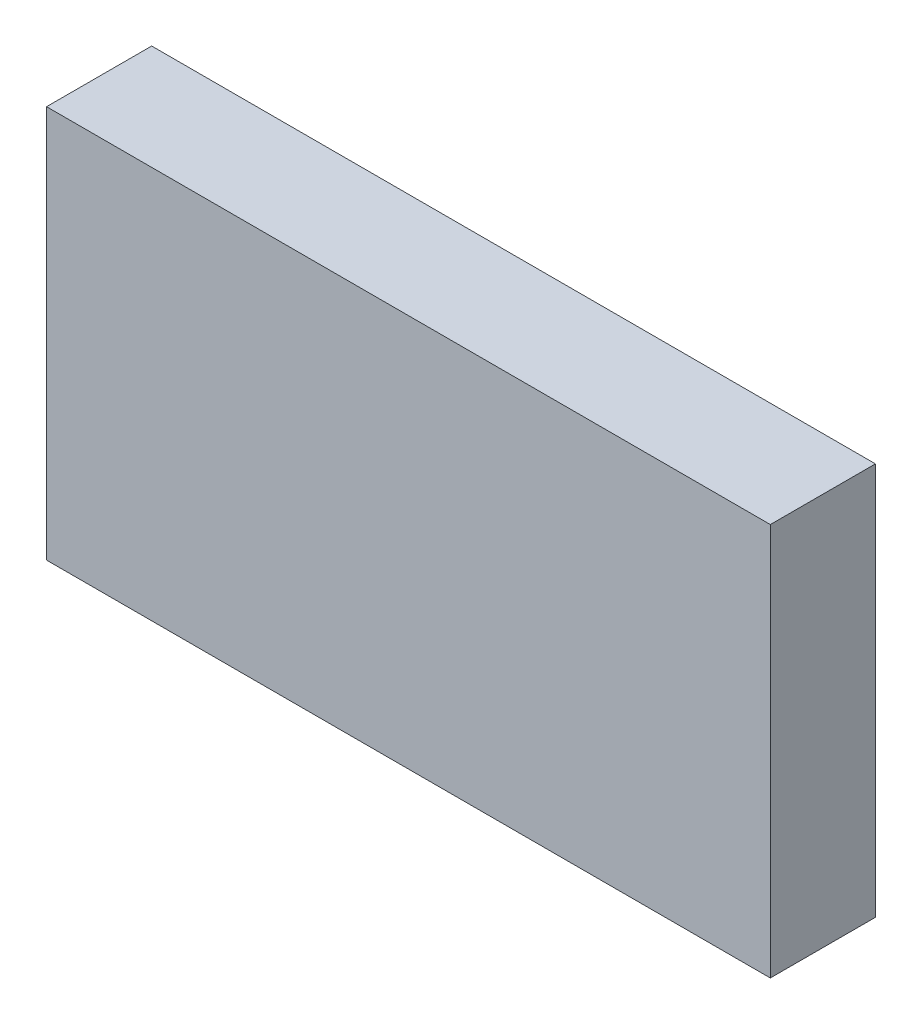
ISO-10303-21;
HEADER;
FILE_DESCRIPTION(('STEP AP214'),'2;1');
FILE_NAME('part.step','',(''),(''),'','','');
FILE_SCHEMA(('AUTOMOTIVE_DESIGN { 1 0 10303 214 1 1 1 1 }'));
ENDSEC;
DATA;
#1=APPLICATION_CONTEXT('core data for automotive mechanical design processes');
#2=APPLICATION_PROTOCOL_DEFINITION('international standard','automotive_design',2000,#1);
#3=PRODUCT_CONTEXT('',#1,'mechanical');
#4=PRODUCT('Part','Part','',(#3));
#5=PRODUCT_RELATED_PRODUCT_CATEGORY('part','',(#4));
#6=PRODUCT_DEFINITION_FORMATION('','',#4);
#7=PRODUCT_DEFINITION_CONTEXT('part definition',#1,'design');
#8=PRODUCT_DEFINITION('design','',#6,#7);
#9=PRODUCT_DEFINITION_SHAPE('','',#8);
#10=(LENGTH_UNIT() NAMED_UNIT(*) SI_UNIT(.MILLI.,.METRE.));
#11=(NAMED_UNIT(*) PLANE_ANGLE_UNIT() SI_UNIT($,.RADIAN.));
#12=(NAMED_UNIT(*) SI_UNIT($,.STERADIAN.) SOLID_ANGLE_UNIT());
#13=UNCERTAINTY_MEASURE_WITH_UNIT(LENGTH_MEASURE(1.E-05),#10,'distance_accuracy_value','');
#14=(GEOMETRIC_REPRESENTATION_CONTEXT(3) GLOBAL_UNCERTAINTY_ASSIGNED_CONTEXT((#13)) GLOBAL_UNIT_ASSIGNED_CONTEXT((#10,
#11,#12)) REPRESENTATION_CONTEXT('',''));
#15=CARTESIAN_POINT('',(0.,0.,0.));
#16=DIRECTION('',(0.,0.,1.));
#17=DIRECTION('',(1.,0.,0.));
#18=AXIS2_PLACEMENT_3D('',#15,#16,#17);
#19=CARTESIAN_POINT('',(-0.87449152,0.47449232,0.));
#20=DIRECTION('',(1.,0.,0.));
#21=DIRECTION('',(0.,-1.,0.));
#22=AXIS2_PLACEMENT_3D('',#19,#20,#21);
#23=PLANE('',#22);
#24=DIRECTION('',(0.,-1.,0.));
#25=VECTOR('',#24,1.);
#26=CARTESIAN_POINT('',(-0.87449152,0.47449232,0.));
#27=LINE('',#26,#25);
#28=CARTESIAN_POINT('',(-0.87449152,0.47449232,0.));
#29=VERTEX_POINT('',#28);
#30=CARTESIAN_POINT('',(-0.87449152,-0.47449232,0.));
#31=VERTEX_POINT('',#30);
#32=EDGE_CURVE('E11',#29,#31,#27,.T.);
#33=ORIENTED_EDGE('',*,*,#32,.T.);
#34=DIRECTION('',(0.,0.,1.));
#35=VECTOR('',#34,1.);
#36=CARTESIAN_POINT('',(-0.87449152,-0.47449232,0.));
#37=LINE('',#36,#35);
#38=CARTESIAN_POINT('',(-0.87449152,-0.47449232,0.254));
#39=VERTEX_POINT('',#38);
#40=EDGE_CURVE('E24',#31,#39,#37,.T.);
#41=ORIENTED_EDGE('',*,*,#40,.T.);
#42=DIRECTION('',(0.,-1.,0.));
#43=VECTOR('',#42,1.);
#44=CARTESIAN_POINT('',(-0.87449152,0.47449232,0.254));
#45=LINE('',#44,#43);
#46=CARTESIAN_POINT('',(-0.87449152,0.47449232,0.254));
#47=VERTEX_POINT('',#46);
#48=EDGE_CURVE('E87',#47,#39,#45,.T.);
#49=ORIENTED_EDGE('',*,*,#48,.F.);
#50=DIRECTION('',(0.,0.,1.));
#51=VECTOR('',#50,1.);
#52=CARTESIAN_POINT('',(-0.87449152,0.47449232,0.));
#53=LINE('',#52,#51);
#54=EDGE_CURVE('E36',#29,#47,#53,.T.);
#55=ORIENTED_EDGE('',*,*,#54,.F.);
#56=EDGE_LOOP('',(#33,#41,#49,#55));
#57=FACE_BOUND('',#56,.T.);
#58=ADVANCED_FACE('F17',(#57),#23,.F.);
#59=CARTESIAN_POINT('',(-0.87449152,-0.47449232,0.));
#60=DIRECTION('',(0.,1.,0.));
#61=DIRECTION('',(1.,0.,0.));
#62=AXIS2_PLACEMENT_3D('',#59,#60,#61);
#63=PLANE('',#62);
#64=DIRECTION('',(1.,0.,0.));
#65=VECTOR('',#64,1.);
#66=CARTESIAN_POINT('',(-0.87449152,-0.47449232,0.));
#67=LINE('',#66,#65);
#68=CARTESIAN_POINT('',(0.87449406,-0.47449232,0.));
#69=VERTEX_POINT('',#68);
#70=EDGE_CURVE('E84',#31,#69,#67,.T.);
#71=ORIENTED_EDGE('',*,*,#70,.T.);
#72=DIRECTION('',(0.,0.,1.));
#73=VECTOR('',#72,1.);
#74=CARTESIAN_POINT('',(0.87449406,-0.47449232,0.));
#75=LINE('',#74,#73);
#76=CARTESIAN_POINT('',(0.87449406,-0.47449232,0.254));
#77=VERTEX_POINT('',#76);
#78=EDGE_CURVE('E82',#69,#77,#75,.T.);
#79=ORIENTED_EDGE('',*,*,#78,.T.);
#80=DIRECTION('',(1.,0.,0.));
#81=VECTOR('',#80,1.);
#82=CARTESIAN_POINT('',(-0.87449152,-0.47449232,0.254));
#83=LINE('',#82,#81);
#84=EDGE_CURVE('E62',#39,#77,#83,.T.);
#85=ORIENTED_EDGE('',*,*,#84,.F.);
#86=ORIENTED_EDGE('',*,*,#40,.F.);
#87=EDGE_LOOP('',(#71,#79,#85,#86));
#88=FACE_BOUND('',#87,.T.);
#89=ADVANCED_FACE('F89',(#88),#63,.F.);
#90=CARTESIAN_POINT('',(0.87449406,-0.47449232,0.));
#91=DIRECTION('',(-1.,0.,0.));
#92=DIRECTION('',(0.,1.,0.));
#93=AXIS2_PLACEMENT_3D('',#90,#91,#92);
#94=PLANE('',#93);
#95=DIRECTION('',(0.,1.,0.));
#96=VECTOR('',#95,1.);
#97=CARTESIAN_POINT('',(0.87449406,-0.47449232,0.));
#98=LINE('',#97,#96);
#99=CARTESIAN_POINT('',(0.87449406,0.47449232,0.));
#100=VERTEX_POINT('',#99);
#101=EDGE_CURVE('E71',#69,#100,#98,.T.);
#102=ORIENTED_EDGE('',*,*,#101,.T.);
#103=DIRECTION('',(0.,0.,1.));
#104=VECTOR('',#103,1.);
#105=CARTESIAN_POINT('',(0.87449406,0.47449232,0.));
#106=LINE('',#105,#104);
#107=CARTESIAN_POINT('',(0.87449406,0.47449232,0.254));
#108=VERTEX_POINT('',#107);
#109=EDGE_CURVE('E65',#100,#108,#106,.T.);
#110=ORIENTED_EDGE('',*,*,#109,.T.);
#111=DIRECTION('',(0.,1.,0.));
#112=VECTOR('',#111,1.);
#113=CARTESIAN_POINT('',(0.87449406,-0.47449232,0.254));
#114=LINE('',#113,#112);
#115=EDGE_CURVE('E57',#77,#108,#114,.T.);
#116=ORIENTED_EDGE('',*,*,#115,.F.);
#117=ORIENTED_EDGE('',*,*,#78,.F.);
#118=EDGE_LOOP('',(#102,#110,#116,#117));
#119=FACE_BOUND('',#118,.T.);
#120=ADVANCED_FACE('F69',(#119),#94,.F.);
#121=CARTESIAN_POINT('',(0.87449406,0.47449232,0.));
#122=DIRECTION('',(0.,-1.,0.));
#123=DIRECTION('',(-1.,0.,0.));
#124=AXIS2_PLACEMENT_3D('',#121,#122,#123);
#125=PLANE('',#124);
#126=DIRECTION('',(-1.,0.,0.));
#127=VECTOR('',#126,1.);
#128=CARTESIAN_POINT('',(0.87449406,0.47449232,0.));
#129=LINE('',#128,#127);
#130=EDGE_CURVE('E66',#100,#29,#129,.T.);
#131=ORIENTED_EDGE('',*,*,#130,.T.);
#132=ORIENTED_EDGE('',*,*,#54,.T.);
#133=DIRECTION('',(-1.,0.,0.));
#134=VECTOR('',#133,1.);
#135=CARTESIAN_POINT('',(0.87449406,0.47449232,0.254));
#136=LINE('',#135,#134);
#137=EDGE_CURVE('E61',#108,#47,#136,.T.);
#138=ORIENTED_EDGE('',*,*,#137,.F.);
#139=ORIENTED_EDGE('',*,*,#109,.F.);
#140=EDGE_LOOP('',(#131,#132,#138,#139));
#141=FACE_BOUND('',#140,.T.);
#142=ADVANCED_FACE('F76',(#141),#125,.F.);
#143=CARTESIAN_POINT('',(-0.87449152,0.47449232,0.));
#144=DIRECTION('',(0.,0.,-1.));
#145=DIRECTION('',(-1.,0.,0.));
#146=AXIS2_PLACEMENT_3D('',#143,#144,#145);
#147=PLANE('',#146);
#148=ORIENTED_EDGE('',*,*,#130,.F.);
#149=ORIENTED_EDGE('',*,*,#101,.F.);
#150=ORIENTED_EDGE('',*,*,#70,.F.);
#151=ORIENTED_EDGE('',*,*,#32,.F.);
#152=EDGE_LOOP('',(#148,#149,#150,#151));
#153=FACE_BOUND('',#152,.T.);
#154=ADVANCED_FACE('F91',(#153),#147,.T.);
#155=CARTESIAN_POINT('',(-0.87449152,0.47449232,0.254));
#156=DIRECTION('',(0.,0.,-1.));
#157=DIRECTION('',(-1.,0.,0.));
#158=AXIS2_PLACEMENT_3D('',#155,#156,#157);
#159=PLANE('',#158);
#160=ORIENTED_EDGE('',*,*,#48,.T.);
#161=ORIENTED_EDGE('',*,*,#84,.T.);
#162=ORIENTED_EDGE('',*,*,#115,.T.);
#163=ORIENTED_EDGE('',*,*,#137,.T.);
#164=EDGE_LOOP('',(#160,#161,#162,#163));
#165=FACE_BOUND('',#164,.T.);
#166=ADVANCED_FACE('F59',(#165),#159,.F.);
#167=CLOSED_SHELL('',(#58,#89,#120,#142,#154,#166));
#168=MANIFOLD_SOLID_BREP('B1',#167);
#169=ADVANCED_BREP_SHAPE_REPRESENTATION('',(#18,#168),#14);
#170=SHAPE_DEFINITION_REPRESENTATION(#9,#169);
ENDSEC;
END-ISO-10303-21;
